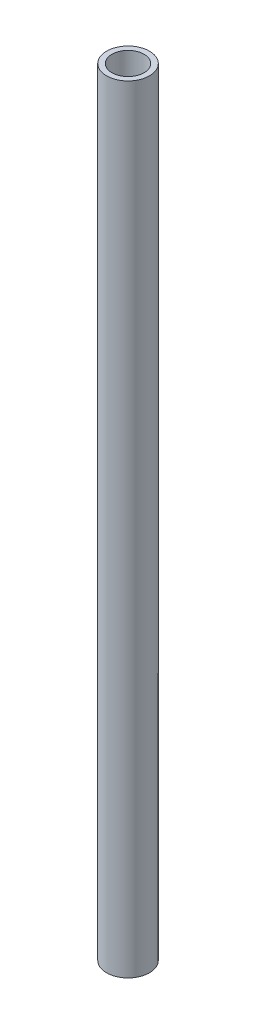
ISO-10303-21;
HEADER;
FILE_DESCRIPTION(('STEP AP214'),'2;1');
FILE_NAME('part.step','',(''),(''),'','','');
FILE_SCHEMA(('AUTOMOTIVE_DESIGN { 1 0 10303 214 1 1 1 1 }'));
ENDSEC;
DATA;
#1=APPLICATION_CONTEXT('core data for automotive mechanical design processes');
#2=APPLICATION_PROTOCOL_DEFINITION('international standard','automotive_design',2000,#1);
#3=PRODUCT_CONTEXT('',#1,'mechanical');
#4=PRODUCT('Part','Part','',(#3));
#5=PRODUCT_RELATED_PRODUCT_CATEGORY('part','',(#4));
#6=PRODUCT_DEFINITION_FORMATION('','',#4);
#7=PRODUCT_DEFINITION_CONTEXT('part definition',#1,'design');
#8=PRODUCT_DEFINITION('design','',#6,#7);
#9=PRODUCT_DEFINITION_SHAPE('','',#8);
#10=(LENGTH_UNIT() NAMED_UNIT(*) SI_UNIT(.MILLI.,.METRE.));
#11=(NAMED_UNIT(*) PLANE_ANGLE_UNIT() SI_UNIT($,.RADIAN.));
#12=(NAMED_UNIT(*) SI_UNIT($,.STERADIAN.) SOLID_ANGLE_UNIT());
#13=UNCERTAINTY_MEASURE_WITH_UNIT(LENGTH_MEASURE(1.E-05),#10,'distance_accuracy_value','');
#14=(GEOMETRIC_REPRESENTATION_CONTEXT(3) GLOBAL_UNCERTAINTY_ASSIGNED_CONTEXT((#13)) GLOBAL_UNIT_ASSIGNED_CONTEXT((#10,
#11,#12)) REPRESENTATION_CONTEXT('',''));
#15=CARTESIAN_POINT('',(0.,0.,0.));
#16=DIRECTION('',(0.,0.,1.));
#17=DIRECTION('',(1.,0.,0.));
#18=AXIS2_PLACEMENT_3D('',#15,#16,#17);
#19=CARTESIAN_POINT('',(0.,290.,0.));
#20=DIRECTION('',(0.,-1.,0.));
#21=DIRECTION('',(0.,0.,-1.));
#22=AXIS2_PLACEMENT_3D('',#19,#20,#21);
#23=CYLINDRICAL_SURFACE('',#22,6.);
#24=CARTESIAN_POINT('',(0.,290.,0.));
#25=DIRECTION('',(0.,-1.,0.));
#26=DIRECTION('',(0.,0.,-1.));
#27=AXIS2_PLACEMENT_3D('',#24,#25,#26);
#28=CIRCLE('',#27,6.);
#29=CARTESIAN_POINT('',(0.,290.,-6.));
#30=VERTEX_POINT('',#29);
#31=EDGE_CURVE('E44',#30,#30,#28,.T.);
#32=ORIENTED_EDGE('',*,*,#31,.F.);
#33=EDGE_LOOP('',(#32));
#34=FACE_BOUND('',#33,.T.);
#35=CARTESIAN_POINT('',(0.,0.,0.));
#36=DIRECTION('',(0.,-1.,0.));
#37=DIRECTION('',(0.,0.,-1.));
#38=AXIS2_PLACEMENT_3D('',#35,#36,#37);
#39=CIRCLE('',#38,6.);
#40=CARTESIAN_POINT('',(0.,0.,-6.));
#41=VERTEX_POINT('',#40);
#42=EDGE_CURVE('E50',#41,#41,#39,.T.);
#43=ORIENTED_EDGE('',*,*,#42,.T.);
#44=EDGE_LOOP('',(#43));
#45=FACE_BOUND('',#44,.T.);
#46=ADVANCED_FACE('F36',(#34,#45),#23,.F.);
#47=CARTESIAN_POINT('',(0.,290.,0.));
#48=DIRECTION('',(0.,-1.,0.));
#49=DIRECTION('',(0.,0.,-1.));
#50=AXIS2_PLACEMENT_3D('',#47,#48,#49);
#51=CYLINDRICAL_SURFACE('',#50,8.);
#52=CARTESIAN_POINT('',(0.,290.,0.));
#53=DIRECTION('',(0.,-1.,0.));
#54=DIRECTION('',(0.,0.,-1.));
#55=AXIS2_PLACEMENT_3D('',#52,#53,#54);
#56=CIRCLE('',#55,8.);
#57=CARTESIAN_POINT('',(0.,290.,-8.));
#58=VERTEX_POINT('',#57);
#59=EDGE_CURVE('E10',#58,#58,#56,.T.);
#60=ORIENTED_EDGE('',*,*,#59,.T.);
#61=EDGE_LOOP('',(#60));
#62=FACE_BOUND('',#61,.T.);
#63=CARTESIAN_POINT('',(0.,0.,0.));
#64=DIRECTION('',(0.,-1.,0.));
#65=DIRECTION('',(0.,0.,-1.));
#66=AXIS2_PLACEMENT_3D('',#63,#64,#65);
#67=CIRCLE('',#66,8.);
#68=CARTESIAN_POINT('',(0.,0.,-8.));
#69=VERTEX_POINT('',#68);
#70=EDGE_CURVE('E40',#69,#69,#67,.T.);
#71=ORIENTED_EDGE('',*,*,#70,.F.);
#72=EDGE_LOOP('',(#71));
#73=FACE_BOUND('',#72,.T.);
#74=ADVANCED_FACE('F38',(#62,#73),#51,.T.);
#75=CARTESIAN_POINT('',(6.,290.,0.));
#76=DIRECTION('',(0.,1.,0.));
#77=DIRECTION('',(0.,0.,1.));
#78=AXIS2_PLACEMENT_3D('',#75,#76,#77);
#79=PLANE('',#78);
#80=ORIENTED_EDGE('',*,*,#31,.T.);
#81=EDGE_LOOP('',(#80));
#82=FACE_BOUND('',#81,.T.);
#83=ORIENTED_EDGE('',*,*,#59,.F.);
#84=EDGE_LOOP('',(#83));
#85=FACE_BOUND('',#84,.T.);
#86=ADVANCED_FACE('F60',(#82,#85),#79,.T.);
#87=CARTESIAN_POINT('',(6.,0.,0.));
#88=DIRECTION('',(0.,1.,0.));
#89=DIRECTION('',(0.,0.,1.));
#90=AXIS2_PLACEMENT_3D('',#87,#88,#89);
#91=PLANE('',#90);
#92=ORIENTED_EDGE('',*,*,#42,.F.);
#93=EDGE_LOOP('',(#92));
#94=FACE_BOUND('',#93,.T.);
#95=ORIENTED_EDGE('',*,*,#70,.T.);
#96=EDGE_LOOP('',(#95));
#97=FACE_BOUND('',#96,.T.);
#98=ADVANCED_FACE('F57',(#94,#97),#91,.F.);
#99=CLOSED_SHELL('',(#46,#74,#86,#98));
#100=MANIFOLD_SOLID_BREP('B2',#99);
#101=ADVANCED_BREP_SHAPE_REPRESENTATION('',(#18,#100),#14);
#102=SHAPE_DEFINITION_REPRESENTATION(#9,#101);
ENDSEC;
END-ISO-10303-21;
